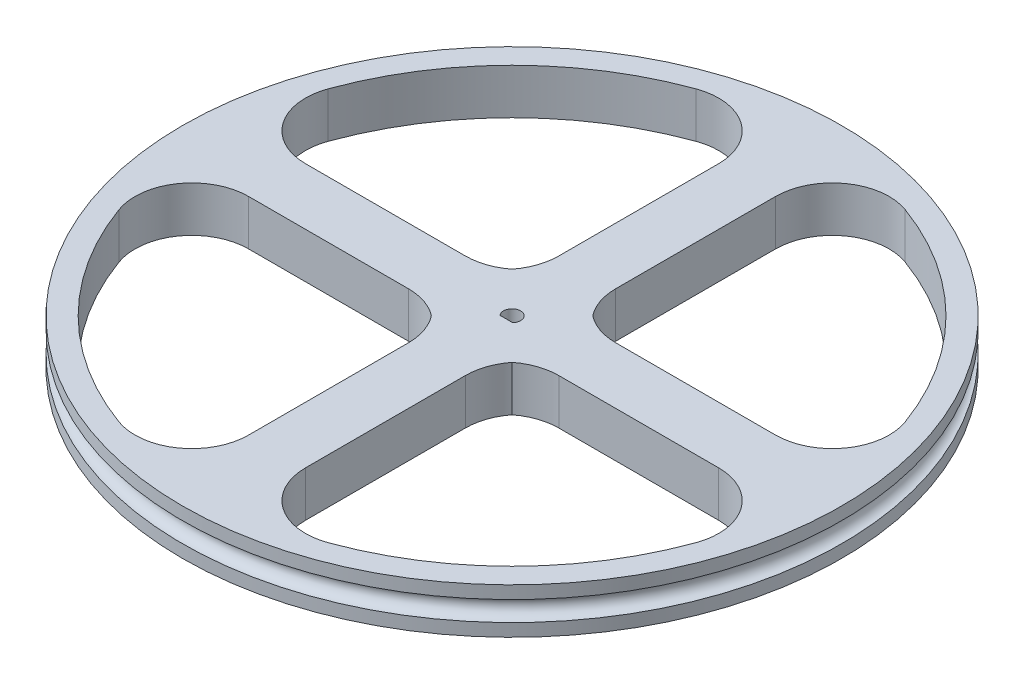
ISO-10303-21;
HEADER;
FILE_DESCRIPTION(('STEP AP214'),'2;1');
FILE_NAME('part.step','',(''),(''),'','','');
FILE_SCHEMA(('AUTOMOTIVE_DESIGN { 1 0 10303 214 1 1 1 1 }'));
ENDSEC;
DATA;
#1=APPLICATION_CONTEXT('core data for automotive mechanical design processes');
#2=APPLICATION_PROTOCOL_DEFINITION('international standard','automotive_design',2000,#1);
#3=PRODUCT_CONTEXT('',#1,'mechanical');
#4=PRODUCT('Part','Part','',(#3));
#5=PRODUCT_RELATED_PRODUCT_CATEGORY('part','',(#4));
#6=PRODUCT_DEFINITION_FORMATION('','',#4);
#7=PRODUCT_DEFINITION_CONTEXT('part definition',#1,'design');
#8=PRODUCT_DEFINITION('design','',#6,#7);
#9=PRODUCT_DEFINITION_SHAPE('','',#8);
#10=(LENGTH_UNIT() NAMED_UNIT(*) SI_UNIT(.MILLI.,.METRE.));
#11=(NAMED_UNIT(*) PLANE_ANGLE_UNIT() SI_UNIT($,.RADIAN.));
#12=(NAMED_UNIT(*) SI_UNIT($,.STERADIAN.) SOLID_ANGLE_UNIT());
#13=UNCERTAINTY_MEASURE_WITH_UNIT(LENGTH_MEASURE(1.E-05),#10,'distance_accuracy_value','');
#14=(GEOMETRIC_REPRESENTATION_CONTEXT(3) GLOBAL_UNCERTAINTY_ASSIGNED_CONTEXT((#13)) GLOBAL_UNIT_ASSIGNED_CONTEXT((#10,
#11,#12)) REPRESENTATION_CONTEXT('',''));
#15=CARTESIAN_POINT('',(0.,0.,0.));
#16=DIRECTION('',(0.,0.,1.));
#17=DIRECTION('',(1.,0.,0.));
#18=AXIS2_PLACEMENT_3D('',#15,#16,#17);
#19=CARTESIAN_POINT('',(0.,8.,0.));
#20=DIRECTION('',(0.,-1.,0.));
#21=DIRECTION('',(0.,0.,-1.));
#22=AXIS2_PLACEMENT_3D('',#19,#20,#21);
#23=CYLINDRICAL_SURFACE('',#22,58.);
#24=CARTESIAN_POINT('',(0.,5.7526,0.));
#25=DIRECTION('',(0.,-1.,0.));
#26=DIRECTION('',(0.,0.,-1.));
#27=AXIS2_PLACEMENT_3D('',#24,#25,#26);
#28=CIRCLE('',#27,58.);
#29=CARTESIAN_POINT('',(-58.,5.7526,0.));
#30=VERTEX_POINT('',#29);
#31=EDGE_CURVE('E12',#30,#30,#28,.F.);
#32=ORIENTED_EDGE('',*,*,#31,.T.);
#33=EDGE_LOOP('',(#32));
#34=FACE_BOUND('',#33,.T.);
#35=CARTESIAN_POINT('',(0.,8.,0.));
#36=DIRECTION('',(0.,1.,0.));
#37=DIRECTION('',(0.,0.,1.));
#38=AXIS2_PLACEMENT_3D('',#35,#36,#37);
#39=CIRCLE('',#38,58.);
#40=CARTESIAN_POINT('',(0.,8.,58.));
#41=VERTEX_POINT('',#40);
#42=EDGE_CURVE('E310',#41,#41,#39,.T.);
#43=ORIENTED_EDGE('',*,*,#42,.F.);
#44=EDGE_LOOP('',(#43));
#45=FACE_BOUND('',#44,.T.);
#46=ADVANCED_FACE('F43',(#34,#45),#23,.T.);
#47=CARTESIAN_POINT('',(0.,8.,0.));
#48=DIRECTION('',(0.,-1.,0.));
#49=DIRECTION('',(0.,0.,-1.));
#50=AXIS2_PLACEMENT_3D('',#47,#48,#49);
#51=CYLINDRICAL_SURFACE('',#50,54.);
#52=CARTESIAN_POINT('',(0.,8.,0.));
#53=DIRECTION('',(0.,1.,0.));
#54=DIRECTION('',(0.,0.,1.));
#55=AXIS2_PLACEMENT_3D('',#52,#53,#54);
#56=CIRCLE('',#55,54.);
#57=CARTESIAN_POINT('',(18.4090909090918,8.,50.7651984325955));
#58=VERTEX_POINT('',#57);
#59=CARTESIAN_POINT('',(50.7651984325957,8.,18.4090909090911));
#60=VERTEX_POINT('',#59);
#61=EDGE_CURVE('E306',#58,#60,#56,.T.);
#62=ORIENTED_EDGE('',*,*,#61,.T.);
#63=DIRECTION('',(0.,-1.,0.));
#64=VECTOR('',#63,1.);
#65=CARTESIAN_POINT('',(50.7651984325957,8.,18.4090909090911));
#66=LINE('',#65,#64);
#67=CARTESIAN_POINT('',(50.7651984325957,0.,18.4090909090911));
#68=VERTEX_POINT('',#67);
#69=EDGE_CURVE('E367',#60,#68,#66,.T.);
#70=ORIENTED_EDGE('',*,*,#69,.T.);
#71=CARTESIAN_POINT('',(0.,0.,0.));
#72=DIRECTION('',(0.,1.,0.));
#73=DIRECTION('',(0.,0.,1.));
#74=AXIS2_PLACEMENT_3D('',#71,#72,#73);
#75=CIRCLE('',#74,54.);
#76=CARTESIAN_POINT('',(18.4090909090918,0.,50.7651984325955));
#77=VERTEX_POINT('',#76);
#78=EDGE_CURVE('E347',#77,#68,#75,.T.);
#79=ORIENTED_EDGE('',*,*,#78,.F.);
#80=DIRECTION('',(0.,-1.,0.));
#81=VECTOR('',#80,1.);
#82=CARTESIAN_POINT('',(18.4090909090918,8.,50.7651984325955));
#83=LINE('',#82,#81);
#84=EDGE_CURVE('E364',#77,#58,#83,.F.);
#85=ORIENTED_EDGE('',*,*,#84,.T.);
#86=EDGE_LOOP('',(#62,#70,#79,#85));
#87=FACE_BOUND('',#86,.T.);
#88=ADVANCED_FACE('F562',(#87),#51,.F.);
#89=CARTESIAN_POINT('',(4.99999999999974,8.,-1.14795078815225E-13));
#90=DIRECTION('',(1.,0.,0.));
#91=DIRECTION('',(0.,0.,-1.));
#92=AXIS2_PLACEMENT_3D('',#89,#90,#91);
#93=PLANE('',#92);
#94=DIRECTION('',(0.,0.,1.));
#95=VECTOR('',#94,1.);
#96=CARTESIAN_POINT('',(4.99999999999974,0.,-1.14795078815225E-13));
#97=LINE('',#96,#95);
#98=CARTESIAN_POINT('',(5.00000000000004,0.,13.2287565553231));
#99=VERTEX_POINT('',#98);
#100=CARTESIAN_POINT('',(5.00000000000069,0.,41.3642357598928));
#101=VERTEX_POINT('',#100);
#102=EDGE_CURVE('E343',#99,#101,#97,.T.);
#103=ORIENTED_EDGE('',*,*,#102,.F.);
#104=DIRECTION('',(0.,-1.,0.));
#105=VECTOR('',#104,1.);
#106=CARTESIAN_POINT('',(5.00000000000004,8.,13.2287565553231));
#107=LINE('',#106,#105);
#108=CARTESIAN_POINT('',(5.00000000000004,8.,13.2287565553231));
#109=VERTEX_POINT('',#108);
#110=EDGE_CURVE('E468',#99,#109,#107,.F.);
#111=ORIENTED_EDGE('',*,*,#110,.T.);
#112=DIRECTION('',(0.,0.,1.));
#113=VECTOR('',#112,1.);
#114=CARTESIAN_POINT('',(4.99999999999974,8.,-1.14795078815225E-13));
#115=LINE('',#114,#113);
#116=CARTESIAN_POINT('',(5.00000000000069,8.,41.3642357598928));
#117=VERTEX_POINT('',#116);
#118=EDGE_CURVE('E302',#109,#117,#115,.T.);
#119=ORIENTED_EDGE('',*,*,#118,.T.);
#120=DIRECTION('',(0.,1.,0.));
#121=VECTOR('',#120,1.);
#122=CARTESIAN_POINT('',(5.00000000000069,0.,41.3642357598928));
#123=LINE('',#122,#121);
#124=EDGE_CURVE('E374',#117,#101,#123,.F.);
#125=ORIENTED_EDGE('',*,*,#124,.T.);
#126=EDGE_LOOP('',(#103,#111,#119,#125));
#127=FACE_BOUND('',#126,.T.);
#128=ADVANCED_FACE('F587',(#127),#93,.T.);
#129=CARTESIAN_POINT('',(0.,8.,-5.));
#130=DIRECTION('',(0.,0.,-1.));
#131=DIRECTION('',(-1.,0.,0.));
#132=AXIS2_PLACEMENT_3D('',#129,#130,#131);
#133=PLANE('',#132);
#134=DIRECTION('',(1.,0.,0.));
#135=VECTOR('',#134,1.);
#136=CARTESIAN_POINT('',(0.,0.,-5.));
#137=LINE('',#136,#135);
#138=CARTESIAN_POINT('',(13.228756555323,0.,-4.99999999999995));
#139=VERTEX_POINT('',#138);
#140=CARTESIAN_POINT('',(41.3642357598929,0.,-4.99999999999986));
#141=VERTEX_POINT('',#140);
#142=EDGE_CURVE('E328',#139,#141,#137,.T.);
#143=ORIENTED_EDGE('',*,*,#142,.F.);
#144=DIRECTION('',(0.,-1.,0.));
#145=VECTOR('',#144,1.);
#146=CARTESIAN_POINT('',(13.228756555323,8.,-4.99999999999995));
#147=LINE('',#146,#145);
#148=CARTESIAN_POINT('',(13.228756555323,8.,-4.99999999999995));
#149=VERTEX_POINT('',#148);
#150=EDGE_CURVE('E465',#139,#149,#147,.F.);
#151=ORIENTED_EDGE('',*,*,#150,.T.);
#152=DIRECTION('',(1.,0.,0.));
#153=VECTOR('',#152,1.);
#154=CARTESIAN_POINT('',(0.,8.,-5.));
#155=LINE('',#154,#153);
#156=CARTESIAN_POINT('',(41.3642357598929,8.,-4.99999999999986));
#157=VERTEX_POINT('',#156);
#158=EDGE_CURVE('E287',#149,#157,#155,.T.);
#159=ORIENTED_EDGE('',*,*,#158,.T.);
#160=DIRECTION('',(0.,1.,0.));
#161=VECTOR('',#160,1.);
#162=CARTESIAN_POINT('',(41.3642357598929,0.,-4.99999999999986));
#163=LINE('',#162,#161);
#164=EDGE_CURVE('E314',#157,#141,#163,.F.);
#165=ORIENTED_EDGE('',*,*,#164,.T.);
#166=EDGE_LOOP('',(#143,#151,#159,#165));
#167=FACE_BOUND('',#166,.T.);
#168=ADVANCED_FACE('F590',(#167),#133,.T.);
#169=CARTESIAN_POINT('',(5.00000000000001,8.,0.));
#170=DIRECTION('',(1.,0.,0.));
#171=DIRECTION('',(0.,0.,-1.));
#172=AXIS2_PLACEMENT_3D('',#169,#170,#171);
#173=PLANE('',#172);
#174=DIRECTION('',(0.,0.,1.));
#175=VECTOR('',#174,1.);
#176=CARTESIAN_POINT('',(5.00000000000001,8.,0.));
#177=LINE('',#176,#175);
#178=CARTESIAN_POINT('',(5.,8.,-41.3642357598929));
#179=VERTEX_POINT('',#178);
#180=CARTESIAN_POINT('',(5.,8.,-13.2287565553229));
#181=VERTEX_POINT('',#180);
#182=EDGE_CURVE('E298',#179,#181,#177,.T.);
#183=ORIENTED_EDGE('',*,*,#182,.T.);
#184=DIRECTION('',(0.,-1.,0.));
#185=VECTOR('',#184,1.);
#186=CARTESIAN_POINT('',(5.,8.,-13.2287565553229));
#187=LINE('',#186,#185);
#188=CARTESIAN_POINT('',(5.,0.,-13.2287565553229));
#189=VERTEX_POINT('',#188);
#190=EDGE_CURVE('E461',#181,#189,#187,.T.);
#191=ORIENTED_EDGE('',*,*,#190,.T.);
#192=DIRECTION('',(0.,0.,1.));
#193=VECTOR('',#192,1.);
#194=CARTESIAN_POINT('',(5.00000000000001,0.,0.));
#195=LINE('',#194,#193);
#196=CARTESIAN_POINT('',(5.,0.,-41.3642357598929));
#197=VERTEX_POINT('',#196);
#198=EDGE_CURVE('E339',#197,#189,#195,.T.);
#199=ORIENTED_EDGE('',*,*,#198,.F.);
#200=DIRECTION('',(0.,1.,0.));
#201=VECTOR('',#200,1.);
#202=CARTESIAN_POINT('',(5.,8.,-41.3642357598929));
#203=LINE('',#202,#201);
#204=EDGE_CURVE('E406',#197,#179,#203,.T.);
#205=ORIENTED_EDGE('',*,*,#204,.T.);
#206=EDGE_LOOP('',(#183,#191,#199,#205));
#207=FACE_BOUND('',#206,.T.);
#208=ADVANCED_FACE('F595',(#207),#173,.T.);
#209=CARTESIAN_POINT('',(-5.,8.,0.));
#210=DIRECTION('',(-1.,0.,0.));
#211=DIRECTION('',(0.,0.,1.));
#212=AXIS2_PLACEMENT_3D('',#209,#210,#211);
#213=PLANE('',#212);
#214=DIRECTION('',(0.,0.,-1.));
#215=VECTOR('',#214,1.);
#216=CARTESIAN_POINT('',(-5.,0.,0.));
#217=LINE('',#216,#215);
#218=CARTESIAN_POINT('',(-5.,0.,-13.228756555323));
#219=VERTEX_POINT('',#218);
#220=CARTESIAN_POINT('',(-5.,0.,-41.3642357598929));
#221=VERTEX_POINT('',#220);
#222=EDGE_CURVE('E331',#219,#221,#217,.T.);
#223=ORIENTED_EDGE('',*,*,#222,.F.);
#224=DIRECTION('',(0.,-1.,0.));
#225=VECTOR('',#224,1.);
#226=CARTESIAN_POINT('',(-5.,8.,-13.228756555323));
#227=LINE('',#226,#225);
#228=CARTESIAN_POINT('',(-5.,8.,-13.228756555323));
#229=VERTEX_POINT('',#228);
#230=EDGE_CURVE('E486',#219,#229,#227,.F.);
#231=ORIENTED_EDGE('',*,*,#230,.T.);
#232=DIRECTION('',(0.,0.,-1.));
#233=VECTOR('',#232,1.);
#234=CARTESIAN_POINT('',(-5.,8.,0.));
#235=LINE('',#234,#233);
#236=CARTESIAN_POINT('',(-5.,8.,-41.3642357598929));
#237=VERTEX_POINT('',#236);
#238=EDGE_CURVE('E290',#229,#237,#235,.T.);
#239=ORIENTED_EDGE('',*,*,#238,.T.);
#240=DIRECTION('',(0.,1.,0.));
#241=VECTOR('',#240,1.);
#242=CARTESIAN_POINT('',(-5.,0.,-41.3642357598929));
#243=LINE('',#242,#241);
#244=EDGE_CURVE('E402',#237,#221,#243,.F.);
#245=ORIENTED_EDGE('',*,*,#244,.T.);
#246=EDGE_LOOP('',(#223,#231,#239,#245));
#247=FACE_BOUND('',#246,.T.);
#248=ADVANCED_FACE('F598',(#247),#213,.T.);
#249=CARTESIAN_POINT('',(0.,8.,-5.00000000000027));
#250=DIRECTION('',(0.,0.,-1.));
#251=DIRECTION('',(-1.,0.,0.));
#252=AXIS2_PLACEMENT_3D('',#249,#250,#251);
#253=PLANE('',#252);
#254=DIRECTION('',(1.,0.,0.));
#255=VECTOR('',#254,1.);
#256=CARTESIAN_POINT('',(0.,8.,-5.00000000000027));
#257=LINE('',#256,#255);
#258=CARTESIAN_POINT('',(-41.3642357598929,8.,-4.99999999999946));
#259=VERTEX_POINT('',#258);
#260=CARTESIAN_POINT('',(-13.2287565553227,8.,-5.00000000000001));
#261=VERTEX_POINT('',#260);
#262=EDGE_CURVE('E288',#259,#261,#257,.T.);
#263=ORIENTED_EDGE('',*,*,#262,.T.);
#264=DIRECTION('',(0.,-1.,0.));
#265=VECTOR('',#264,1.);
#266=CARTESIAN_POINT('',(-13.2287565553227,8.,-5.00000000000001));
#267=LINE('',#266,#265);
#268=CARTESIAN_POINT('',(-13.2287565553227,0.,-5.00000000000001));
#269=VERTEX_POINT('',#268);
#270=EDGE_CURVE('E482',#261,#269,#267,.T.);
#271=ORIENTED_EDGE('',*,*,#270,.T.);
#272=DIRECTION('',(1.,0.,0.));
#273=VECTOR('',#272,1.);
#274=CARTESIAN_POINT('',(0.,0.,-5.00000000000027));
#275=LINE('',#274,#273);
#276=CARTESIAN_POINT('',(-41.3642357598929,0.,-4.99999999999946));
#277=VERTEX_POINT('',#276);
#278=EDGE_CURVE('E329',#277,#269,#275,.T.);
#279=ORIENTED_EDGE('',*,*,#278,.F.);
#280=DIRECTION('',(0.,1.,0.));
#281=VECTOR('',#280,1.);
#282=CARTESIAN_POINT('',(-41.3642357598929,8.,-4.99999999999946));
#283=LINE('',#282,#281);
#284=EDGE_CURVE('E399',#277,#259,#283,.T.);
#285=ORIENTED_EDGE('',*,*,#284,.T.);
#286=EDGE_LOOP('',(#263,#271,#279,#285));
#287=FACE_BOUND('',#286,.T.);
#288=ADVANCED_FACE('F603',(#287),#253,.T.);
#289=CARTESIAN_POINT('',(0.,8.,4.99999999999974));
#290=DIRECTION('',(0.,0.,1.));
#291=DIRECTION('',(1.,0.,0.));
#292=AXIS2_PLACEMENT_3D('',#289,#290,#291);
#293=PLANE('',#292);
#294=DIRECTION('',(-1.,0.,0.));
#295=VECTOR('',#294,1.);
#296=CARTESIAN_POINT('',(0.,0.,4.99999999999974));
#297=LINE('',#296,#295);
#298=CARTESIAN_POINT('',(-13.2287565553232,0.,4.99999999999999));
#299=VERTEX_POINT('',#298);
#300=CARTESIAN_POINT('',(-41.3642357598929,0.,5.00000000000054));
#301=VERTEX_POINT('',#300);
#302=EDGE_CURVE('E315',#299,#301,#297,.T.);
#303=ORIENTED_EDGE('',*,*,#302,.F.);
#304=DIRECTION('',(0.,-1.,0.));
#305=VECTOR('',#304,1.);
#306=CARTESIAN_POINT('',(-13.2287565553232,8.,4.99999999999999));
#307=LINE('',#306,#305);
#308=CARTESIAN_POINT('',(-13.2287565553232,8.,4.99999999999999));
#309=VERTEX_POINT('',#308);
#310=EDGE_CURVE('E475',#299,#309,#307,.F.);
#311=ORIENTED_EDGE('',*,*,#310,.T.);
#312=DIRECTION('',(-1.,0.,0.));
#313=VECTOR('',#312,1.);
#314=CARTESIAN_POINT('',(0.,8.,4.99999999999974));
#315=LINE('',#314,#313);
#316=CARTESIAN_POINT('',(-41.3642357598929,8.,5.00000000000054));
#317=VERTEX_POINT('',#316);
#318=EDGE_CURVE('E274',#309,#317,#315,.T.);
#319=ORIENTED_EDGE('',*,*,#318,.T.);
#320=DIRECTION('',(0.,1.,0.));
#321=VECTOR('',#320,1.);
#322=CARTESIAN_POINT('',(-41.3642357598929,0.,5.00000000000054));
#323=LINE('',#322,#321);
#324=EDGE_CURVE('E388',#317,#301,#323,.F.);
#325=ORIENTED_EDGE('',*,*,#324,.T.);
#326=EDGE_LOOP('',(#303,#311,#319,#325));
#327=FACE_BOUND('',#326,.T.);
#328=ADVANCED_FACE('F606',(#327),#293,.T.);
#329=CARTESIAN_POINT('',(-5.00000000000027,8.,1.15468081789866E-13));
#330=DIRECTION('',(-1.,0.,0.));
#331=DIRECTION('',(0.,0.,1.));
#332=AXIS2_PLACEMENT_3D('',#329,#330,#331);
#333=PLANE('',#332);
#334=DIRECTION('',(0.,0.,-1.));
#335=VECTOR('',#334,1.);
#336=CARTESIAN_POINT('',(-5.00000000000027,8.,1.15468081789866E-13));
#337=LINE('',#336,#335);
#338=CARTESIAN_POINT('',(-4.99999999999931,8.,41.3642357598929));
#339=VERTEX_POINT('',#338);
#340=CARTESIAN_POINT('',(-4.99999999999996,8.,13.2287565553228));
#341=VERTEX_POINT('',#340);
#342=EDGE_CURVE('E277',#339,#341,#337,.T.);
#343=ORIENTED_EDGE('',*,*,#342,.T.);
#344=DIRECTION('',(0.,-1.,0.));
#345=VECTOR('',#344,1.);
#346=CARTESIAN_POINT('',(-4.99999999999996,8.,13.2287565553228));
#347=LINE('',#346,#345);
#348=CARTESIAN_POINT('',(-4.99999999999996,0.,13.2287565553228));
#349=VERTEX_POINT('',#348);
#350=EDGE_CURVE('E479',#341,#349,#347,.T.);
#351=ORIENTED_EDGE('',*,*,#350,.T.);
#352=DIRECTION('',(0.,0.,-1.));
#353=VECTOR('',#352,1.);
#354=CARTESIAN_POINT('',(-5.00000000000027,0.,1.15468081789866E-13));
#355=LINE('',#354,#353);
#356=CARTESIAN_POINT('',(-4.99999999999931,0.,41.3642357598929));
#357=VERTEX_POINT('',#356);
#358=EDGE_CURVE('E318',#357,#349,#355,.T.);
#359=ORIENTED_EDGE('',*,*,#358,.F.);
#360=DIRECTION('',(0.,1.,0.));
#361=VECTOR('',#360,1.);
#362=CARTESIAN_POINT('',(-4.99999999999931,8.,41.3642357598929));
#363=LINE('',#362,#361);
#364=EDGE_CURVE('E385',#357,#339,#363,.T.);
#365=ORIENTED_EDGE('',*,*,#364,.T.);
#366=EDGE_LOOP('',(#343,#351,#359,#365));
#367=FACE_BOUND('',#366,.T.);
#368=ADVANCED_FACE('F585',(#367),#333,.T.);
#369=CARTESIAN_POINT('',(0.,8.,5.00000000000001));
#370=DIRECTION('',(0.,0.,1.));
#371=DIRECTION('',(1.,0.,0.));
#372=AXIS2_PLACEMENT_3D('',#369,#370,#371);
#373=PLANE('',#372);
#374=DIRECTION('',(-1.,0.,0.));
#375=VECTOR('',#374,1.);
#376=CARTESIAN_POINT('',(0.,8.,5.00000000000001));
#377=LINE('',#376,#375);
#378=CARTESIAN_POINT('',(41.3642357598928,8.,5.00000000000015));
#379=VERTEX_POINT('',#378);
#380=CARTESIAN_POINT('',(13.2287565553229,8.,5.00000000000005));
#381=VERTEX_POINT('',#380);
#382=EDGE_CURVE('E305',#379,#381,#377,.T.);
#383=ORIENTED_EDGE('',*,*,#382,.T.);
#384=DIRECTION('',(0.,-1.,0.));
#385=VECTOR('',#384,1.);
#386=CARTESIAN_POINT('',(13.2287565553229,8.,5.00000000000005));
#387=LINE('',#386,#385);
#388=CARTESIAN_POINT('',(13.2287565553229,0.,5.00000000000005));
#389=VERTEX_POINT('',#388);
#390=EDGE_CURVE('E472',#381,#389,#387,.T.);
#391=ORIENTED_EDGE('',*,*,#390,.T.);
#392=DIRECTION('',(-1.,0.,0.));
#393=VECTOR('',#392,1.);
#394=CARTESIAN_POINT('',(0.,0.,5.00000000000001));
#395=LINE('',#394,#393);
#396=CARTESIAN_POINT('',(41.3642357598928,0.,5.00000000000015));
#397=VERTEX_POINT('',#396);
#398=EDGE_CURVE('E346',#397,#389,#395,.T.);
#399=ORIENTED_EDGE('',*,*,#398,.F.);
#400=DIRECTION('',(0.,1.,0.));
#401=VECTOR('',#400,1.);
#402=CARTESIAN_POINT('',(41.3642357598928,8.,5.00000000000015));
#403=LINE('',#402,#401);
#404=EDGE_CURVE('E371',#397,#379,#403,.T.);
#405=ORIENTED_EDGE('',*,*,#404,.T.);
#406=EDGE_LOOP('',(#383,#391,#399,#405));
#407=FACE_BOUND('',#406,.T.);
#408=ADVANCED_FACE('F581',(#407),#373,.T.);
#409=CARTESIAN_POINT('',(50.7651984325959,0.,-18.4090909090907));
#410=VERTEX_POINT('',#409);
#411=CARTESIAN_POINT('',(18.4090909090909,0.,-50.7651984325958));
#412=VERTEX_POINT('',#411);
#413=EDGE_CURVE('E330',#410,#412,#75,.T.);
#414=ORIENTED_EDGE('',*,*,#413,.F.);
#415=DIRECTION('',(0.,-1.,0.));
#416=VECTOR('',#415,1.);
#417=CARTESIAN_POINT('',(50.7651984325959,8.,-18.4090909090907));
#418=LINE('',#417,#416);
#419=CARTESIAN_POINT('',(50.7651984325959,8.,-18.4090909090907));
#420=VERTEX_POINT('',#419);
#421=EDGE_CURVE('E361',#410,#420,#418,.F.);
#422=ORIENTED_EDGE('',*,*,#421,.T.);
#423=CARTESIAN_POINT('',(18.4090909090909,8.,-50.7651984325958));
#424=VERTEX_POINT('',#423);
#425=EDGE_CURVE('E289',#420,#424,#56,.T.);
#426=ORIENTED_EDGE('',*,*,#425,.T.);
#427=DIRECTION('',(0.,-1.,0.));
#428=VECTOR('',#427,1.);
#429=CARTESIAN_POINT('',(18.4090909090909,8.,-50.7651984325958));
#430=LINE('',#429,#428);
#431=EDGE_CURVE('E357',#424,#412,#430,.T.);
#432=ORIENTED_EDGE('',*,*,#431,.T.);
#433=EDGE_LOOP('',(#414,#422,#426,#432));
#434=FACE_BOUND('',#433,.T.);
#435=ADVANCED_FACE('F584',(#434),#51,.F.);
#436=CARTESIAN_POINT('',(-18.4090909090909,8.,-50.7651984325958));
#437=VERTEX_POINT('',#436);
#438=CARTESIAN_POINT('',(-50.765198432596,8.,-18.4090909090902));
#439=VERTEX_POINT('',#438);
#440=EDGE_CURVE('E283',#437,#439,#56,.T.);
#441=ORIENTED_EDGE('',*,*,#440,.T.);
#442=DIRECTION('',(0.,-1.,0.));
#443=VECTOR('',#442,1.);
#444=CARTESIAN_POINT('',(-50.765198432596,8.,-18.4090909090902));
#445=LINE('',#444,#443);
#446=CARTESIAN_POINT('',(-50.765198432596,0.,-18.4090909090902));
#447=VERTEX_POINT('',#446);
#448=EDGE_CURVE('E395',#439,#447,#445,.T.);
#449=ORIENTED_EDGE('',*,*,#448,.T.);
#450=CARTESIAN_POINT('',(-18.4090909090909,0.,-50.7651984325958));
#451=VERTEX_POINT('',#450);
#452=EDGE_CURVE('E324',#451,#447,#75,.T.);
#453=ORIENTED_EDGE('',*,*,#452,.F.);
#454=DIRECTION('',(0.,-1.,0.));
#455=VECTOR('',#454,1.);
#456=CARTESIAN_POINT('',(-18.4090909090909,8.,-50.7651984325958));
#457=LINE('',#456,#455);
#458=EDGE_CURVE('E392',#451,#437,#457,.F.);
#459=ORIENTED_EDGE('',*,*,#458,.T.);
#460=EDGE_LOOP('',(#441,#449,#453,#459));
#461=FACE_BOUND('',#460,.T.);
#462=ADVANCED_FACE('F694',(#461),#51,.F.);
#463=CARTESIAN_POINT('',(-50.7651984325956,8.,18.4090909090916));
#464=VERTEX_POINT('',#463);
#465=CARTESIAN_POINT('',(-18.4090909090901,8.,50.7651984325961));
#466=VERTEX_POINT('',#465);
#467=EDGE_CURVE('E282',#464,#466,#56,.T.);
#468=ORIENTED_EDGE('',*,*,#467,.T.);
#469=DIRECTION('',(0.,-1.,0.));
#470=VECTOR('',#469,1.);
#471=CARTESIAN_POINT('',(-18.4090909090901,8.,50.7651984325961));
#472=LINE('',#471,#470);
#473=CARTESIAN_POINT('',(-18.4090909090901,0.,50.7651984325961));
#474=VERTEX_POINT('',#473);
#475=EDGE_CURVE('E381',#466,#474,#472,.T.);
#476=ORIENTED_EDGE('',*,*,#475,.T.);
#477=CARTESIAN_POINT('',(-50.7651984325956,0.,18.4090909090916));
#478=VERTEX_POINT('',#477);
#479=EDGE_CURVE('E323',#478,#474,#75,.T.);
#480=ORIENTED_EDGE('',*,*,#479,.F.);
#481=DIRECTION('',(0.,-1.,0.));
#482=VECTOR('',#481,1.);
#483=CARTESIAN_POINT('',(-50.7651984325956,8.,18.4090909090916));
#484=LINE('',#483,#482);
#485=EDGE_CURVE('E378',#478,#464,#484,.F.);
#486=ORIENTED_EDGE('',*,*,#485,.T.);
#487=EDGE_LOOP('',(#468,#476,#480,#486));
#488=FACE_BOUND('',#487,.T.);
#489=ADVANCED_FACE('F576',(#488),#51,.F.);
#490=CARTESIAN_POINT('',(0.,2.2474,0.));
#491=DIRECTION('',(0.,1.,0.));
#492=DIRECTION('',(0.,0.,1.));
#493=AXIS2_PLACEMENT_3D('',#490,#491,#492);
#494=CIRCLE('',#493,58.);
#495=CARTESIAN_POINT('',(-58.,2.2474,0.));
#496=VERTEX_POINT('',#495);
#497=EDGE_CURVE('E52',#496,#496,#494,.F.);
#498=ORIENTED_EDGE('',*,*,#497,.T.);
#499=EDGE_LOOP('',(#498));
#500=FACE_BOUND('',#499,.T.);
#501=CARTESIAN_POINT('',(0.,0.,0.));
#502=DIRECTION('',(0.,1.,0.));
#503=DIRECTION('',(0.,0.,1.));
#504=AXIS2_PLACEMENT_3D('',#501,#502,#503);
#505=CIRCLE('',#504,58.);
#506=CARTESIAN_POINT('',(0.,0.,58.));
#507=VERTEX_POINT('',#506);
#508=EDGE_CURVE('E278',#507,#507,#505,.T.);
#509=ORIENTED_EDGE('',*,*,#508,.T.);
#510=EDGE_LOOP('',(#509));
#511=FACE_BOUND('',#510,.T.);
#512=ADVANCED_FACE('F554',(#500,#511),#23,.T.);
#513=CARTESIAN_POINT('',(0.,8.,0.));
#514=DIRECTION('',(0.,1.,0.));
#515=DIRECTION('',(0.,0.,1.));
#516=AXIS2_PLACEMENT_3D('',#513,#514,#515);
#517=PLANE('',#516);
#518=DIRECTION('',(1.,0.,0.));
#519=VECTOR('',#518,1.);
#520=CARTESIAN_POINT('',(0.,8.,1.));
#521=LINE('',#520,#519);
#522=CARTESIAN_POINT('',(-1.11803398874989,8.,1.));
#523=VERTEX_POINT('',#522);
#524=CARTESIAN_POINT('',(1.11803398874989,8.,1.));
#525=VERTEX_POINT('',#524);
#526=EDGE_CURVE('E247',#523,#525,#521,.T.);
#527=ORIENTED_EDGE('',*,*,#526,.F.);
#528=CARTESIAN_POINT('',(0.,8.,0.));
#529=DIRECTION('',(0.,1.,0.));
#530=DIRECTION('',(0.,0.,1.));
#531=AXIS2_PLACEMENT_3D('',#528,#529,#530);
#532=CIRCLE('',#531,1.5);
#533=EDGE_CURVE('E250',#525,#523,#532,.T.);
#534=ORIENTED_EDGE('',*,*,#533,.F.);
#535=EDGE_LOOP('',(#527,#534));
#536=FACE_BOUND('',#535,.T.);
#537=CARTESIAN_POINT('',(-13.228756555323,8.,15.));
#538=DIRECTION('',(0.,1.,0.));
#539=DIRECTION('',(0.,0.,1.));
#540=AXIS2_PLACEMENT_3D('',#537,#538,#539);
#541=CIRCLE('',#540,10.);
#542=CARTESIAN_POINT('',(-7.09898989461936,8.,7.09898989461937));
#543=VERTEX_POINT('',#542);
#544=EDGE_CURVE('E516',#309,#543,#541,.F.);
#545=ORIENTED_EDGE('',*,*,#544,.T.);
#546=CARTESIAN_POINT('',(-15.,8.,13.228756555323));
#547=DIRECTION('',(0.,1.,0.));
#548=DIRECTION('',(0.,0.,1.));
#549=AXIS2_PLACEMENT_3D('',#546,#547,#548);
#550=CIRCLE('',#549,10.);
#551=EDGE_CURVE('E522',#543,#341,#550,.F.);
#552=ORIENTED_EDGE('',*,*,#551,.T.);
#553=ORIENTED_EDGE('',*,*,#342,.F.);
#554=CARTESIAN_POINT('',(-14.9999999999993,8.,41.3642357598931));
#555=DIRECTION('',(0.,1.,0.));
#556=DIRECTION('',(0.,0.,1.));
#557=AXIS2_PLACEMENT_3D('',#554,#555,#556);
#558=CIRCLE('',#557,10.);
#559=EDGE_CURVE('E432',#339,#466,#558,.F.);
#560=ORIENTED_EDGE('',*,*,#559,.T.);
#561=ORIENTED_EDGE('',*,*,#467,.F.);
#562=CARTESIAN_POINT('',(-41.3642357598927,8.,15.0000000000005));
#563=DIRECTION('',(0.,1.,0.));
#564=DIRECTION('',(0.,0.,1.));
#565=AXIS2_PLACEMENT_3D('',#562,#563,#564);
#566=CIRCLE('',#565,10.);
#567=EDGE_CURVE('E438',#464,#317,#566,.F.);
#568=ORIENTED_EDGE('',*,*,#567,.T.);
#569=ORIENTED_EDGE('',*,*,#318,.F.);
#570=EDGE_LOOP('',(#545,#552,#553,#560,#561,#568,#569));
#571=FACE_BOUND('',#570,.T.);
#572=ORIENTED_EDGE('',*,*,#238,.F.);
#573=CARTESIAN_POINT('',(-15.,8.,-13.228756555323));
#574=DIRECTION('',(0.,1.,0.));
#575=DIRECTION('',(0.,0.,1.));
#576=AXIS2_PLACEMENT_3D('',#573,#574,#575);
#577=CIRCLE('',#576,10.);
#578=CARTESIAN_POINT('',(-7.09898989461936,8.,-7.09898989461938));
#579=VERTEX_POINT('',#578);
#580=EDGE_CURVE('E534',#229,#579,#577,.F.);
#581=ORIENTED_EDGE('',*,*,#580,.T.);
#582=CARTESIAN_POINT('',(-13.2287565553229,8.,-15.));
#583=DIRECTION('',(0.,1.,0.));
#584=DIRECTION('',(0.,0.,1.));
#585=AXIS2_PLACEMENT_3D('',#582,#583,#584);
#586=CIRCLE('',#585,10.);
#587=EDGE_CURVE('E528',#579,#261,#586,.F.);
#588=ORIENTED_EDGE('',*,*,#587,.T.);
#589=ORIENTED_EDGE('',*,*,#262,.F.);
#590=CARTESIAN_POINT('',(-41.3642357598931,8.,-14.9999999999995));
#591=DIRECTION('',(0.,1.,0.));
#592=DIRECTION('',(0.,0.,1.));
#593=AXIS2_PLACEMENT_3D('',#590,#591,#592);
#594=CIRCLE('',#593,10.);
#595=EDGE_CURVE('E445',#259,#439,#594,.F.);
#596=ORIENTED_EDGE('',*,*,#595,.T.);
#597=ORIENTED_EDGE('',*,*,#440,.F.);
#598=CARTESIAN_POINT('',(-15.,8.,-41.3642357598929));
#599=DIRECTION('',(0.,1.,0.));
#600=DIRECTION('',(0.,0.,1.));
#601=AXIS2_PLACEMENT_3D('',#598,#599,#600);
#602=CIRCLE('',#601,10.);
#603=EDGE_CURVE('E451',#437,#237,#602,.F.);
#604=ORIENTED_EDGE('',*,*,#603,.T.);
#605=EDGE_LOOP('',(#572,#581,#588,#589,#596,#597,#604));
#606=FACE_BOUND('',#605,.T.);
#607=ORIENTED_EDGE('',*,*,#158,.F.);
#608=CARTESIAN_POINT('',(13.228756555323,8.,-15.));
#609=DIRECTION('',(0.,1.,0.));
#610=DIRECTION('',(0.,0.,1.));
#611=AXIS2_PLACEMENT_3D('',#608,#609,#610);
#612=CIRCLE('',#611,10.);
#613=CARTESIAN_POINT('',(7.09898989461938,8.,-7.09898989461935));
#614=VERTEX_POINT('',#613);
#615=EDGE_CURVE('E498',#149,#614,#612,.F.);
#616=ORIENTED_EDGE('',*,*,#615,.T.);
#617=CARTESIAN_POINT('',(15.,8.,-13.2287565553229));
#618=DIRECTION('',(0.,1.,0.));
#619=DIRECTION('',(0.,0.,1.));
#620=AXIS2_PLACEMENT_3D('',#617,#618,#619);
#621=CIRCLE('',#620,10.);
#622=EDGE_CURVE('E492',#614,#181,#621,.F.);
#623=ORIENTED_EDGE('',*,*,#622,.T.);
#624=ORIENTED_EDGE('',*,*,#182,.F.);
#625=CARTESIAN_POINT('',(15.,8.,-41.3642357598929));
#626=DIRECTION('',(0.,1.,0.));
#627=DIRECTION('',(0.,0.,1.));
#628=AXIS2_PLACEMENT_3D('',#625,#626,#627);
#629=CIRCLE('',#628,10.);
#630=EDGE_CURVE('E458',#179,#424,#629,.F.);
#631=ORIENTED_EDGE('',*,*,#630,.T.);
#632=ORIENTED_EDGE('',*,*,#425,.F.);
#633=CARTESIAN_POINT('',(41.3642357598929,8.,-14.9999999999999));
#634=DIRECTION('',(0.,1.,0.));
#635=DIRECTION('',(0.,0.,1.));
#636=AXIS2_PLACEMENT_3D('',#633,#634,#635);
#637=CIRCLE('',#636,10.);
#638=EDGE_CURVE('E412',#420,#157,#637,.F.);
#639=ORIENTED_EDGE('',*,*,#638,.T.);
#640=EDGE_LOOP('',(#607,#616,#623,#624,#631,#632,#639));
#641=FACE_BOUND('',#640,.T.);
#642=ORIENTED_EDGE('',*,*,#61,.F.);
#643=CARTESIAN_POINT('',(15.0000000000007,8.,41.3642357598926));
#644=DIRECTION('',(0.,1.,0.));
#645=DIRECTION('',(0.,0.,1.));
#646=AXIS2_PLACEMENT_3D('',#643,#644,#645);
#647=CIRCLE('',#646,10.);
#648=EDGE_CURVE('E425',#58,#117,#647,.F.);
#649=ORIENTED_EDGE('',*,*,#648,.T.);
#650=ORIENTED_EDGE('',*,*,#118,.F.);
#651=CARTESIAN_POINT('',(15.,8.,13.2287565553229));
#652=DIRECTION('',(0.,1.,0.));
#653=DIRECTION('',(0.,0.,1.));
#654=AXIS2_PLACEMENT_3D('',#651,#652,#653);
#655=CIRCLE('',#654,10.);
#656=CARTESIAN_POINT('',(7.09898989461937,8.,7.09898989461938));
#657=VERTEX_POINT('',#656);
#658=EDGE_CURVE('E504',#109,#657,#655,.F.);
#659=ORIENTED_EDGE('',*,*,#658,.T.);
#660=CARTESIAN_POINT('',(13.2287565553229,8.,15.0000000000001));
#661=DIRECTION('',(0.,1.,0.));
#662=DIRECTION('',(0.,0.,1.));
#663=AXIS2_PLACEMENT_3D('',#660,#661,#662);
#664=CIRCLE('',#663,10.);
#665=EDGE_CURVE('E510',#657,#381,#664,.F.);
#666=ORIENTED_EDGE('',*,*,#665,.T.);
#667=ORIENTED_EDGE('',*,*,#382,.F.);
#668=CARTESIAN_POINT('',(41.3642357598928,8.,15.0000000000001));
#669=DIRECTION('',(0.,1.,0.));
#670=DIRECTION('',(0.,0.,1.));
#671=AXIS2_PLACEMENT_3D('',#668,#669,#670);
#672=CIRCLE('',#671,10.);
#673=EDGE_CURVE('E419',#379,#60,#672,.F.);
#674=ORIENTED_EDGE('',*,*,#673,.T.);
#675=EDGE_LOOP('',(#642,#649,#650,#659,#666,#667,#674));
#676=FACE_BOUND('',#675,.T.);
#677=ORIENTED_EDGE('',*,*,#42,.T.);
#678=EDGE_LOOP('',(#677));
#679=FACE_BOUND('',#678,.T.);
#680=ADVANCED_FACE('F566',(#536,#571,#606,#641,#676,#679),#517,.T.);
#681=CARTESIAN_POINT('',(0.,0.,0.));
#682=DIRECTION('',(0.,1.,0.));
#683=DIRECTION('',(0.,0.,1.));
#684=AXIS2_PLACEMENT_3D('',#681,#682,#683);
#685=PLANE('',#684);
#686=CARTESIAN_POINT('',(0.,0.,0.));
#687=DIRECTION('',(0.,-1.,0.));
#688=DIRECTION('',(0.,0.,-1.));
#689=AXIS2_PLACEMENT_3D('',#686,#687,#688);
#690=CIRCLE('',#689,1.5);
#691=CARTESIAN_POINT('',(-1.11803398874989,0.,1.));
#692=VERTEX_POINT('',#691);
#693=CARTESIAN_POINT('',(1.11803398874989,0.,1.));
#694=VERTEX_POINT('',#693);
#695=EDGE_CURVE('E254',#692,#694,#690,.T.);
#696=ORIENTED_EDGE('',*,*,#695,.F.);
#697=DIRECTION('',(-1.,0.,0.));
#698=VECTOR('',#697,1.);
#699=CARTESIAN_POINT('',(0.,0.,1.));
#700=LINE('',#699,#698);
#701=EDGE_CURVE('E66',#694,#692,#700,.T.);
#702=ORIENTED_EDGE('',*,*,#701,.F.);
#703=EDGE_LOOP('',(#696,#702));
#704=FACE_BOUND('',#703,.T.);
#705=ORIENTED_EDGE('',*,*,#358,.T.);
#706=CARTESIAN_POINT('',(-15.,0.,13.228756555323));
#707=DIRECTION('',(0.,1.,0.));
#708=DIRECTION('',(0.,0.,1.));
#709=AXIS2_PLACEMENT_3D('',#706,#707,#708);
#710=CIRCLE('',#709,10.);
#711=CARTESIAN_POINT('',(-7.09898989461936,0.,7.09898989461937));
#712=VERTEX_POINT('',#711);
#713=EDGE_CURVE('E519',#349,#712,#710,.T.);
#714=ORIENTED_EDGE('',*,*,#713,.T.);
#715=CARTESIAN_POINT('',(-13.228756555323,0.,15.));
#716=DIRECTION('',(0.,1.,0.));
#717=DIRECTION('',(0.,0.,1.));
#718=AXIS2_PLACEMENT_3D('',#715,#716,#717);
#719=CIRCLE('',#718,10.);
#720=EDGE_CURVE('E513',#712,#299,#719,.T.);
#721=ORIENTED_EDGE('',*,*,#720,.T.);
#722=ORIENTED_EDGE('',*,*,#302,.T.);
#723=CARTESIAN_POINT('',(-41.3642357598927,0.,15.0000000000005));
#724=DIRECTION('',(0.,1.,0.));
#725=DIRECTION('',(0.,0.,1.));
#726=AXIS2_PLACEMENT_3D('',#723,#724,#725);
#727=CIRCLE('',#726,10.);
#728=EDGE_CURVE('E435',#301,#478,#727,.T.);
#729=ORIENTED_EDGE('',*,*,#728,.T.);
#730=ORIENTED_EDGE('',*,*,#479,.T.);
#731=CARTESIAN_POINT('',(-14.9999999999993,0.,41.3642357598931));
#732=DIRECTION('',(0.,1.,0.));
#733=DIRECTION('',(0.,0.,1.));
#734=AXIS2_PLACEMENT_3D('',#731,#732,#733);
#735=CIRCLE('',#734,10.);
#736=EDGE_CURVE('E429',#474,#357,#735,.T.);
#737=ORIENTED_EDGE('',*,*,#736,.T.);
#738=EDGE_LOOP('',(#705,#714,#721,#722,#729,#730,#737));
#739=FACE_BOUND('',#738,.T.);
#740=CARTESIAN_POINT('',(-13.2287565553229,0.,-15.));
#741=DIRECTION('',(0.,1.,0.));
#742=DIRECTION('',(0.,0.,1.));
#743=AXIS2_PLACEMENT_3D('',#740,#741,#742);
#744=CIRCLE('',#743,10.);
#745=CARTESIAN_POINT('',(-7.09898989461936,0.,-7.09898989461938));
#746=VERTEX_POINT('',#745);
#747=EDGE_CURVE('E525',#269,#746,#744,.T.);
#748=ORIENTED_EDGE('',*,*,#747,.T.);
#749=CARTESIAN_POINT('',(-15.,0.,-13.228756555323));
#750=DIRECTION('',(0.,1.,0.));
#751=DIRECTION('',(0.,0.,1.));
#752=AXIS2_PLACEMENT_3D('',#749,#750,#751);
#753=CIRCLE('',#752,10.);
#754=EDGE_CURVE('E531',#746,#219,#753,.T.);
#755=ORIENTED_EDGE('',*,*,#754,.T.);
#756=ORIENTED_EDGE('',*,*,#222,.T.);
#757=CARTESIAN_POINT('',(-15.,0.,-41.3642357598929));
#758=DIRECTION('',(0.,1.,0.));
#759=DIRECTION('',(0.,0.,1.));
#760=AXIS2_PLACEMENT_3D('',#757,#758,#759);
#761=CIRCLE('',#760,10.);
#762=EDGE_CURVE('E448',#221,#451,#761,.T.);
#763=ORIENTED_EDGE('',*,*,#762,.T.);
#764=ORIENTED_EDGE('',*,*,#452,.T.);
#765=CARTESIAN_POINT('',(-41.3642357598931,0.,-14.9999999999995));
#766=DIRECTION('',(0.,1.,0.));
#767=DIRECTION('',(0.,0.,1.));
#768=AXIS2_PLACEMENT_3D('',#765,#766,#767);
#769=CIRCLE('',#768,10.);
#770=EDGE_CURVE('E442',#447,#277,#769,.T.);
#771=ORIENTED_EDGE('',*,*,#770,.T.);
#772=ORIENTED_EDGE('',*,*,#278,.T.);
#773=EDGE_LOOP('',(#748,#755,#756,#763,#764,#771,#772));
#774=FACE_BOUND('',#773,.T.);
#775=CARTESIAN_POINT('',(15.,0.,-13.2287565553229));
#776=DIRECTION('',(0.,1.,0.));
#777=DIRECTION('',(0.,0.,1.));
#778=AXIS2_PLACEMENT_3D('',#775,#776,#777);
#779=CIRCLE('',#778,10.);
#780=CARTESIAN_POINT('',(7.09898989461938,0.,-7.09898989461935));
#781=VERTEX_POINT('',#780);
#782=EDGE_CURVE('E489',#189,#781,#779,.T.);
#783=ORIENTED_EDGE('',*,*,#782,.T.);
#784=CARTESIAN_POINT('',(13.228756555323,0.,-15.));
#785=DIRECTION('',(0.,1.,0.));
#786=DIRECTION('',(0.,0.,1.));
#787=AXIS2_PLACEMENT_3D('',#784,#785,#786);
#788=CIRCLE('',#787,10.);
#789=EDGE_CURVE('E495',#781,#139,#788,.T.);
#790=ORIENTED_EDGE('',*,*,#789,.T.);
#791=ORIENTED_EDGE('',*,*,#142,.T.);
#792=CARTESIAN_POINT('',(41.3642357598929,0.,-14.9999999999999));
#793=DIRECTION('',(0.,1.,0.));
#794=DIRECTION('',(0.,0.,1.));
#795=AXIS2_PLACEMENT_3D('',#792,#793,#794);
#796=CIRCLE('',#795,10.);
#797=EDGE_CURVE('E409',#141,#410,#796,.T.);
#798=ORIENTED_EDGE('',*,*,#797,.T.);
#799=ORIENTED_EDGE('',*,*,#413,.T.);
#800=CARTESIAN_POINT('',(15.,0.,-41.3642357598929));
#801=DIRECTION('',(0.,1.,0.));
#802=DIRECTION('',(0.,0.,1.));
#803=AXIS2_PLACEMENT_3D('',#800,#801,#802);
#804=CIRCLE('',#803,10.);
#805=EDGE_CURVE('E455',#412,#197,#804,.T.);
#806=ORIENTED_EDGE('',*,*,#805,.T.);
#807=ORIENTED_EDGE('',*,*,#198,.T.);
#808=EDGE_LOOP('',(#783,#790,#791,#798,#799,#806,#807));
#809=FACE_BOUND('',#808,.T.);
#810=ORIENTED_EDGE('',*,*,#398,.T.);
#811=CARTESIAN_POINT('',(13.2287565553229,0.,15.0000000000001));
#812=DIRECTION('',(0.,1.,0.));
#813=DIRECTION('',(0.,0.,1.));
#814=AXIS2_PLACEMENT_3D('',#811,#812,#813);
#815=CIRCLE('',#814,10.);
#816=CARTESIAN_POINT('',(7.09898989461937,0.,7.09898989461938));
#817=VERTEX_POINT('',#816);
#818=EDGE_CURVE('E507',#389,#817,#815,.T.);
#819=ORIENTED_EDGE('',*,*,#818,.T.);
#820=CARTESIAN_POINT('',(15.,0.,13.2287565553229));
#821=DIRECTION('',(0.,1.,0.));
#822=DIRECTION('',(0.,0.,1.));
#823=AXIS2_PLACEMENT_3D('',#820,#821,#822);
#824=CIRCLE('',#823,10.);
#825=EDGE_CURVE('E501',#817,#99,#824,.T.);
#826=ORIENTED_EDGE('',*,*,#825,.T.);
#827=ORIENTED_EDGE('',*,*,#102,.T.);
#828=CARTESIAN_POINT('',(15.0000000000007,0.,41.3642357598926));
#829=DIRECTION('',(0.,1.,0.));
#830=DIRECTION('',(0.,0.,1.));
#831=AXIS2_PLACEMENT_3D('',#828,#829,#830);
#832=CIRCLE('',#831,10.);
#833=EDGE_CURVE('E422',#101,#77,#832,.T.);
#834=ORIENTED_EDGE('',*,*,#833,.T.);
#835=ORIENTED_EDGE('',*,*,#78,.T.);
#836=CARTESIAN_POINT('',(41.3642357598928,0.,15.0000000000001));
#837=DIRECTION('',(0.,1.,0.));
#838=DIRECTION('',(0.,0.,1.));
#839=AXIS2_PLACEMENT_3D('',#836,#837,#838);
#840=CIRCLE('',#839,10.);
#841=EDGE_CURVE('E416',#68,#397,#840,.T.);
#842=ORIENTED_EDGE('',*,*,#841,.T.);
#843=EDGE_LOOP('',(#810,#819,#826,#827,#834,#835,#842));
#844=FACE_BOUND('',#843,.T.);
#845=ORIENTED_EDGE('',*,*,#508,.F.);
#846=EDGE_LOOP('',(#845));
#847=FACE_BOUND('',#846,.T.);
#848=ADVANCED_FACE('F259',(#704,#739,#774,#809,#844,#847),#685,.F.);
#849=CARTESIAN_POINT('',(41.3642357598929,8.,-14.9999999999999));
#850=DIRECTION('',(0.,-1.,0.));
#851=DIRECTION('',(0.,0.,-1.));
#852=AXIS2_PLACEMENT_3D('',#849,#850,#851);
#853=CYLINDRICAL_SURFACE('',#852,10.);
#854=ORIENTED_EDGE('',*,*,#638,.F.);
#855=ORIENTED_EDGE('',*,*,#421,.F.);
#856=ORIENTED_EDGE('',*,*,#797,.F.);
#857=ORIENTED_EDGE('',*,*,#164,.F.);
#858=EDGE_LOOP('',(#854,#855,#856,#857));
#859=FACE_BOUND('',#858,.T.);
#860=ADVANCED_FACE('F574',(#859),#853,.F.);
#861=CARTESIAN_POINT('',(41.3642357598928,8.,15.0000000000001));
#862=DIRECTION('',(0.,-1.,0.));
#863=DIRECTION('',(0.,0.,-1.));
#864=AXIS2_PLACEMENT_3D('',#861,#862,#863);
#865=CYLINDRICAL_SURFACE('',#864,10.);
#866=ORIENTED_EDGE('',*,*,#673,.F.);
#867=ORIENTED_EDGE('',*,*,#404,.F.);
#868=ORIENTED_EDGE('',*,*,#841,.F.);
#869=ORIENTED_EDGE('',*,*,#69,.F.);
#870=EDGE_LOOP('',(#866,#867,#868,#869));
#871=FACE_BOUND('',#870,.T.);
#872=ADVANCED_FACE('F619',(#871),#865,.F.);
#873=CARTESIAN_POINT('',(15.0000000000007,8.,41.3642357598926));
#874=DIRECTION('',(0.,-1.,0.));
#875=DIRECTION('',(0.,0.,-1.));
#876=AXIS2_PLACEMENT_3D('',#873,#874,#875);
#877=CYLINDRICAL_SURFACE('',#876,10.);
#878=ORIENTED_EDGE('',*,*,#648,.F.);
#879=ORIENTED_EDGE('',*,*,#84,.F.);
#880=ORIENTED_EDGE('',*,*,#833,.F.);
#881=ORIENTED_EDGE('',*,*,#124,.F.);
#882=EDGE_LOOP('',(#878,#879,#880,#881));
#883=FACE_BOUND('',#882,.T.);
#884=ADVANCED_FACE('F623',(#883),#877,.F.);
#885=CARTESIAN_POINT('',(-14.9999999999993,8.,41.3642357598931));
#886=DIRECTION('',(0.,-1.,0.));
#887=DIRECTION('',(0.,0.,-1.));
#888=AXIS2_PLACEMENT_3D('',#885,#886,#887);
#889=CYLINDRICAL_SURFACE('',#888,10.);
#890=ORIENTED_EDGE('',*,*,#559,.F.);
#891=ORIENTED_EDGE('',*,*,#364,.F.);
#892=ORIENTED_EDGE('',*,*,#736,.F.);
#893=ORIENTED_EDGE('',*,*,#475,.F.);
#894=EDGE_LOOP('',(#890,#891,#892,#893));
#895=FACE_BOUND('',#894,.T.);
#896=ADVANCED_FACE('F627',(#895),#889,.F.);
#897=CARTESIAN_POINT('',(-41.3642357598927,8.,15.0000000000005));
#898=DIRECTION('',(0.,-1.,0.));
#899=DIRECTION('',(0.,0.,-1.));
#900=AXIS2_PLACEMENT_3D('',#897,#898,#899);
#901=CYLINDRICAL_SURFACE('',#900,10.);
#902=ORIENTED_EDGE('',*,*,#567,.F.);
#903=ORIENTED_EDGE('',*,*,#485,.F.);
#904=ORIENTED_EDGE('',*,*,#728,.F.);
#905=ORIENTED_EDGE('',*,*,#324,.F.);
#906=EDGE_LOOP('',(#902,#903,#904,#905));
#907=FACE_BOUND('',#906,.T.);
#908=ADVANCED_FACE('F631',(#907),#901,.F.);
#909=CARTESIAN_POINT('',(-41.3642357598931,8.,-14.9999999999995));
#910=DIRECTION('',(0.,-1.,0.));
#911=DIRECTION('',(0.,0.,-1.));
#912=AXIS2_PLACEMENT_3D('',#909,#910,#911);
#913=CYLINDRICAL_SURFACE('',#912,10.);
#914=ORIENTED_EDGE('',*,*,#595,.F.);
#915=ORIENTED_EDGE('',*,*,#284,.F.);
#916=ORIENTED_EDGE('',*,*,#770,.F.);
#917=ORIENTED_EDGE('',*,*,#448,.F.);
#918=EDGE_LOOP('',(#914,#915,#916,#917));
#919=FACE_BOUND('',#918,.T.);
#920=ADVANCED_FACE('F635',(#919),#913,.F.);
#921=CARTESIAN_POINT('',(-15.,8.,-41.3642357598929));
#922=DIRECTION('',(0.,-1.,0.));
#923=DIRECTION('',(0.,0.,-1.));
#924=AXIS2_PLACEMENT_3D('',#921,#922,#923);
#925=CYLINDRICAL_SURFACE('',#924,10.);
#926=ORIENTED_EDGE('',*,*,#603,.F.);
#927=ORIENTED_EDGE('',*,*,#458,.F.);
#928=ORIENTED_EDGE('',*,*,#762,.F.);
#929=ORIENTED_EDGE('',*,*,#244,.F.);
#930=EDGE_LOOP('',(#926,#927,#928,#929));
#931=FACE_BOUND('',#930,.T.);
#932=ADVANCED_FACE('F639',(#931),#925,.F.);
#933=CARTESIAN_POINT('',(15.,8.,-41.3642357598929));
#934=DIRECTION('',(0.,-1.,0.));
#935=DIRECTION('',(0.,0.,-1.));
#936=AXIS2_PLACEMENT_3D('',#933,#934,#935);
#937=CYLINDRICAL_SURFACE('',#936,10.);
#938=ORIENTED_EDGE('',*,*,#630,.F.);
#939=ORIENTED_EDGE('',*,*,#204,.F.);
#940=ORIENTED_EDGE('',*,*,#805,.F.);
#941=ORIENTED_EDGE('',*,*,#431,.F.);
#942=EDGE_LOOP('',(#938,#939,#940,#941));
#943=FACE_BOUND('',#942,.T.);
#944=ADVANCED_FACE('F643',(#943),#937,.F.);
#945=CARTESIAN_POINT('',(13.228756555323,8.,-15.));
#946=DIRECTION('',(0.,-1.,0.));
#947=DIRECTION('',(0.,0.,-1.));
#948=AXIS2_PLACEMENT_3D('',#945,#946,#947);
#949=CYLINDRICAL_SURFACE('',#948,10.);
#950=DIRECTION('',(0.,-1.,0.));
#951=VECTOR('',#950,1.);
#952=CARTESIAN_POINT('',(7.09898989461938,4.,-7.09898989461935));
#953=LINE('',#952,#951);
#954=EDGE_CURVE('E319',#614,#781,#953,.T.);
#955=ORIENTED_EDGE('',*,*,#954,.F.);
#956=ORIENTED_EDGE('',*,*,#615,.F.);
#957=ORIENTED_EDGE('',*,*,#150,.F.);
#958=ORIENTED_EDGE('',*,*,#789,.F.);
#959=EDGE_LOOP('',(#955,#956,#957,#958));
#960=FACE_BOUND('',#959,.T.);
#961=ADVANCED_FACE('F647',(#960),#949,.F.);
#962=CARTESIAN_POINT('',(15.,8.,-13.2287565553229));
#963=DIRECTION('',(0.,-1.,0.));
#964=DIRECTION('',(0.,0.,-1.));
#965=AXIS2_PLACEMENT_3D('',#962,#963,#964);
#966=CYLINDRICAL_SURFACE('',#965,10.);
#967=ORIENTED_EDGE('',*,*,#622,.F.);
#968=ORIENTED_EDGE('',*,*,#954,.T.);
#969=ORIENTED_EDGE('',*,*,#782,.F.);
#970=ORIENTED_EDGE('',*,*,#190,.F.);
#971=EDGE_LOOP('',(#967,#968,#969,#970));
#972=FACE_BOUND('',#971,.T.);
#973=ADVANCED_FACE('F649',(#972),#966,.F.);
#974=CARTESIAN_POINT('',(13.2287565553229,8.,15.0000000000001));
#975=DIRECTION('',(0.,-1.,0.));
#976=DIRECTION('',(0.,0.,-1.));
#977=AXIS2_PLACEMENT_3D('',#974,#975,#976);
#978=CYLINDRICAL_SURFACE('',#977,10.);
#979=ORIENTED_EDGE('',*,*,#390,.F.);
#980=ORIENTED_EDGE('',*,*,#665,.F.);
#981=DIRECTION('',(0.,-1.,0.));
#982=VECTOR('',#981,1.);
#983=CARTESIAN_POINT('',(7.09898989461937,4.,7.09898989461938));
#984=LINE('',#983,#982);
#985=EDGE_CURVE('E540',#817,#657,#984,.F.);
#986=ORIENTED_EDGE('',*,*,#985,.F.);
#987=ORIENTED_EDGE('',*,*,#818,.F.);
#988=EDGE_LOOP('',(#979,#980,#986,#987));
#989=FACE_BOUND('',#988,.T.);
#990=ADVANCED_FACE('F652',(#989),#978,.F.);
#991=CARTESIAN_POINT('',(15.,8.,13.2287565553229));
#992=DIRECTION('',(0.,-1.,0.));
#993=DIRECTION('',(0.,0.,-1.));
#994=AXIS2_PLACEMENT_3D('',#991,#992,#993);
#995=CYLINDRICAL_SURFACE('',#994,10.);
#996=ORIENTED_EDGE('',*,*,#658,.F.);
#997=ORIENTED_EDGE('',*,*,#110,.F.);
#998=ORIENTED_EDGE('',*,*,#825,.F.);
#999=ORIENTED_EDGE('',*,*,#985,.T.);
#1000=EDGE_LOOP('',(#996,#997,#998,#999));
#1001=FACE_BOUND('',#1000,.T.);
#1002=ADVANCED_FACE('F657',(#1001),#995,.F.);
#1003=CARTESIAN_POINT('',(-15.,8.,13.228756555323));
#1004=DIRECTION('',(0.,-1.,0.));
#1005=DIRECTION('',(0.,0.,-1.));
#1006=AXIS2_PLACEMENT_3D('',#1003,#1004,#1005);
#1007=CYLINDRICAL_SURFACE('',#1006,10.);
#1008=ORIENTED_EDGE('',*,*,#350,.F.);
#1009=ORIENTED_EDGE('',*,*,#551,.F.);
#1010=DIRECTION('',(0.,-1.,0.));
#1011=VECTOR('',#1010,1.);
#1012=CARTESIAN_POINT('',(-7.09898989461936,4.,7.09898989461937));
#1013=LINE('',#1012,#1011);
#1014=EDGE_CURVE('E544',#712,#543,#1013,.F.);
#1015=ORIENTED_EDGE('',*,*,#1014,.F.);
#1016=ORIENTED_EDGE('',*,*,#713,.F.);
#1017=EDGE_LOOP('',(#1008,#1009,#1015,#1016));
#1018=FACE_BOUND('',#1017,.T.);
#1019=ADVANCED_FACE('F660',(#1018),#1007,.F.);
#1020=CARTESIAN_POINT('',(-13.228756555323,8.,15.));
#1021=DIRECTION('',(0.,-1.,0.));
#1022=DIRECTION('',(0.,0.,-1.));
#1023=AXIS2_PLACEMENT_3D('',#1020,#1021,#1022);
#1024=CYLINDRICAL_SURFACE('',#1023,10.);
#1025=ORIENTED_EDGE('',*,*,#544,.F.);
#1026=ORIENTED_EDGE('',*,*,#310,.F.);
#1027=ORIENTED_EDGE('',*,*,#720,.F.);
#1028=ORIENTED_EDGE('',*,*,#1014,.T.);
#1029=EDGE_LOOP('',(#1025,#1026,#1027,#1028));
#1030=FACE_BOUND('',#1029,.T.);
#1031=ADVANCED_FACE('F665',(#1030),#1024,.F.);
#1032=CARTESIAN_POINT('',(-15.,8.,-13.228756555323));
#1033=DIRECTION('',(0.,-1.,0.));
#1034=DIRECTION('',(0.,0.,-1.));
#1035=AXIS2_PLACEMENT_3D('',#1032,#1033,#1034);
#1036=CYLINDRICAL_SURFACE('',#1035,10.);
#1037=DIRECTION('',(0.,-1.,0.));
#1038=VECTOR('',#1037,1.);
#1039=CARTESIAN_POINT('',(-7.09898989461936,4.,-7.09898989461938));
#1040=LINE('',#1039,#1038);
#1041=EDGE_CURVE('E273',#579,#746,#1040,.T.);
#1042=ORIENTED_EDGE('',*,*,#1041,.F.);
#1043=ORIENTED_EDGE('',*,*,#580,.F.);
#1044=ORIENTED_EDGE('',*,*,#230,.F.);
#1045=ORIENTED_EDGE('',*,*,#754,.F.);
#1046=EDGE_LOOP('',(#1042,#1043,#1044,#1045));
#1047=FACE_BOUND('',#1046,.T.);
#1048=ADVANCED_FACE('F45',(#1047),#1036,.F.);
#1049=CARTESIAN_POINT('',(-13.2287565553229,8.,-15.));
#1050=DIRECTION('',(0.,-1.,0.));
#1051=DIRECTION('',(0.,0.,-1.));
#1052=AXIS2_PLACEMENT_3D('',#1049,#1050,#1051);
#1053=CYLINDRICAL_SURFACE('',#1052,10.);
#1054=ORIENTED_EDGE('',*,*,#587,.F.);
#1055=ORIENTED_EDGE('',*,*,#1041,.T.);
#1056=ORIENTED_EDGE('',*,*,#747,.F.);
#1057=ORIENTED_EDGE('',*,*,#270,.F.);
#1058=EDGE_LOOP('',(#1054,#1055,#1056,#1057));
#1059=FACE_BOUND('',#1058,.T.);
#1060=ADVANCED_FACE('F671',(#1059),#1053,.F.);
#1061=CARTESIAN_POINT('',(0.,4.,0.));
#1062=DIRECTION('',(0.,1.,0.));
#1063=DIRECTION('',(0.,0.,1.));
#1064=AXIS2_PLACEMENT_3D('',#1061,#1062,#1063);
#1065=TOROIDAL_SURFACE('',#1064,58.,1.7526);
#1066=CARTESIAN_POINT('',(-58.,4.,0.));
#1067=DIRECTION('',(0.,0.,1.));
#1068=DIRECTION('',(1.,0.,0.));
#1069=AXIS2_PLACEMENT_3D('',#1066,#1067,#1068);
#1070=CIRCLE('',#1069,1.7526);
#1071=EDGE_CURVE('E270',#496,#30,#1070,.T.);
#1072=ORIENTED_EDGE('',*,*,#1071,.F.);
#1073=ORIENTED_EDGE('',*,*,#497,.F.);
#1074=ORIENTED_EDGE('',*,*,#1071,.T.);
#1075=ORIENTED_EDGE('',*,*,#31,.F.);
#1076=EDGE_LOOP('',(#1072,#1073,#1074,#1075));
#1077=FACE_BOUND('',#1076,.T.);
#1078=ADVANCED_FACE('F557',(#1077),#1065,.F.);
#1079=CARTESIAN_POINT('',(0.,20.,1.));
#1080=DIRECTION('',(0.,0.,1.));
#1081=DIRECTION('',(1.,0.,0.));
#1082=AXIS2_PLACEMENT_3D('',#1079,#1080,#1081);
#1083=PLANE('',#1082);
#1084=ORIENTED_EDGE('',*,*,#526,.T.);
#1085=DIRECTION('',(0.,-1.,0.));
#1086=VECTOR('',#1085,1.);
#1087=CARTESIAN_POINT('',(1.11803398874989,20.,1.));
#1088=LINE('',#1087,#1086);
#1089=EDGE_CURVE('E59',#525,#694,#1088,.T.);
#1090=ORIENTED_EDGE('',*,*,#1089,.T.);
#1091=ORIENTED_EDGE('',*,*,#701,.T.);
#1092=DIRECTION('',(0.,-1.,0.));
#1093=VECTOR('',#1092,1.);
#1094=CARTESIAN_POINT('',(-1.11803398874989,20.,1.));
#1095=LINE('',#1094,#1093);
#1096=EDGE_CURVE('E251',#523,#692,#1095,.T.);
#1097=ORIENTED_EDGE('',*,*,#1096,.F.);
#1098=EDGE_LOOP('',(#1084,#1090,#1091,#1097));
#1099=FACE_BOUND('',#1098,.T.);
#1100=ADVANCED_FACE('F245',(#1099),#1083,.F.);
#1101=CARTESIAN_POINT('',(0.,20.,0.));
#1102=DIRECTION('',(0.,-1.,0.));
#1103=DIRECTION('',(0.,0.,-1.));
#1104=AXIS2_PLACEMENT_3D('',#1101,#1102,#1103);
#1105=CYLINDRICAL_SURFACE('',#1104,1.5);
#1106=ORIENTED_EDGE('',*,*,#533,.T.);
#1107=ORIENTED_EDGE('',*,*,#1096,.T.);
#1108=ORIENTED_EDGE('',*,*,#695,.T.);
#1109=ORIENTED_EDGE('',*,*,#1089,.F.);
#1110=EDGE_LOOP('',(#1106,#1107,#1108,#1109));
#1111=FACE_BOUND('',#1110,.T.);
#1112=ADVANCED_FACE('F255',(#1111),#1105,.F.);
#1113=CLOSED_SHELL('',(#46,#88,#128,#168,#208,#248,#288,#328,#368,#408,#435,#462,#489,#512,#680,
#848,#860,#872,#884,#896,#908,#920,#932,#944,#961,#973,#990,#1002,#1019,#1031,#1048,#1060,#1078,
#1100,#1112));
#1114=MANIFOLD_SOLID_BREP('B2',#1113);
#1115=ADVANCED_BREP_SHAPE_REPRESENTATION('',(#18,#1114),#14);
#1116=SHAPE_DEFINITION_REPRESENTATION(#9,#1115);
ENDSEC;
END-ISO-10303-21;
